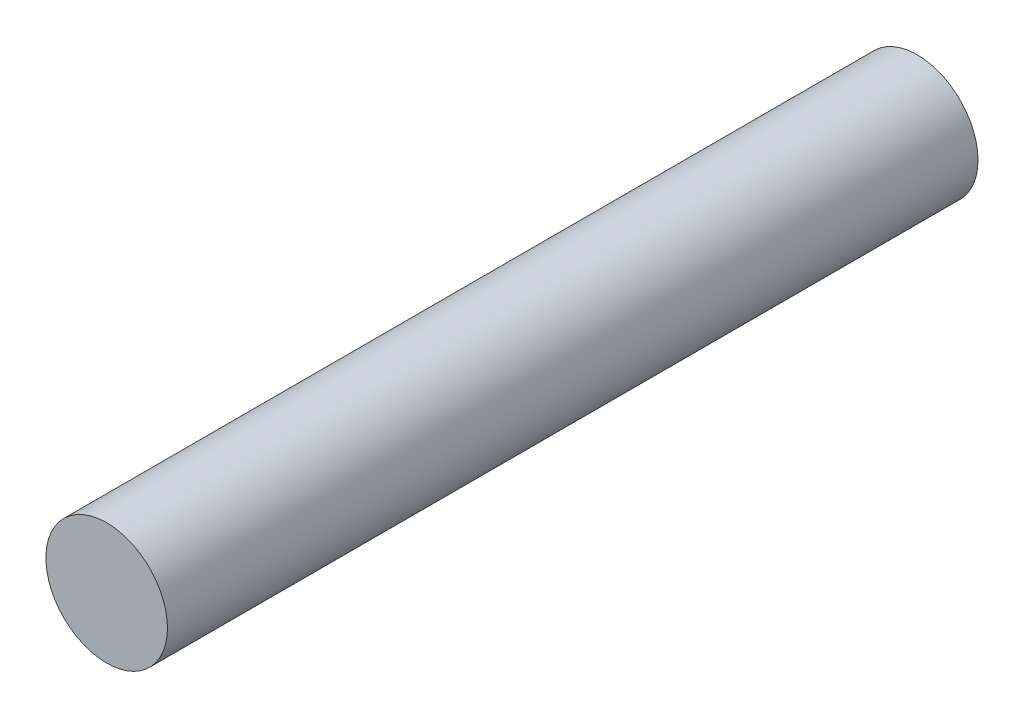
ISO-10303-21;
HEADER;
FILE_DESCRIPTION(('STEP AP214'),'2;1');
FILE_NAME('part.step','',(''),(''),'','','');
FILE_SCHEMA(('AUTOMOTIVE_DESIGN { 1 0 10303 214 1 1 1 1 }'));
ENDSEC;
DATA;
#1=APPLICATION_CONTEXT('core data for automotive mechanical design processes');
#2=APPLICATION_PROTOCOL_DEFINITION('international standard','automotive_design',2000,#1);
#3=PRODUCT_CONTEXT('',#1,'mechanical');
#4=PRODUCT('Part','Part','',(#3));
#5=PRODUCT_RELATED_PRODUCT_CATEGORY('part','',(#4));
#6=PRODUCT_DEFINITION_FORMATION('','',#4);
#7=PRODUCT_DEFINITION_CONTEXT('part definition',#1,'design');
#8=PRODUCT_DEFINITION('design','',#6,#7);
#9=PRODUCT_DEFINITION_SHAPE('','',#8);
#10=(LENGTH_UNIT() NAMED_UNIT(*) SI_UNIT(.MILLI.,.METRE.));
#11=(NAMED_UNIT(*) PLANE_ANGLE_UNIT() SI_UNIT($,.RADIAN.));
#12=(NAMED_UNIT(*) SI_UNIT($,.STERADIAN.) SOLID_ANGLE_UNIT());
#13=UNCERTAINTY_MEASURE_WITH_UNIT(LENGTH_MEASURE(1.E-05),#10,'distance_accuracy_value','');
#14=(GEOMETRIC_REPRESENTATION_CONTEXT(3) GLOBAL_UNCERTAINTY_ASSIGNED_CONTEXT((#13)) GLOBAL_UNIT_ASSIGNED_CONTEXT((#10,
#11,#12)) REPRESENTATION_CONTEXT('',''));
#15=CARTESIAN_POINT('',(0.,0.,0.));
#16=DIRECTION('',(0.,0.,1.));
#17=DIRECTION('',(1.,0.,0.));
#18=AXIS2_PLACEMENT_3D('',#15,#16,#17);
#19=CARTESIAN_POINT('',(0.,0.,254.));
#20=DIRECTION('',(0.,0.,-1.));
#21=DIRECTION('',(-1.,0.,0.));
#22=AXIS2_PLACEMENT_3D('',#19,#20,#21);
#23=CYLINDRICAL_SURFACE('',#22,19.05);
#24=CARTESIAN_POINT('',(0.,0.,254.));
#25=DIRECTION('',(0.,0.,1.));
#26=DIRECTION('',(1.,0.,0.));
#27=AXIS2_PLACEMENT_3D('',#24,#25,#26);
#28=CIRCLE('',#27,19.05);
#29=CARTESIAN_POINT('',(19.05,0.,254.));
#30=VERTEX_POINT('',#29);
#31=EDGE_CURVE('E10',#30,#30,#28,.T.);
#32=ORIENTED_EDGE('',*,*,#31,.F.);
#33=EDGE_LOOP('',(#32));
#34=FACE_BOUND('',#33,.T.);
#35=CARTESIAN_POINT('',(0.,0.,0.));
#36=DIRECTION('',(0.,0.,1.));
#37=DIRECTION('',(1.,0.,0.));
#38=AXIS2_PLACEMENT_3D('',#35,#36,#37);
#39=CIRCLE('',#38,19.05);
#40=CARTESIAN_POINT('',(19.05,0.,0.));
#41=VERTEX_POINT('',#40);
#42=EDGE_CURVE('E34',#41,#41,#39,.T.);
#43=ORIENTED_EDGE('',*,*,#42,.T.);
#44=EDGE_LOOP('',(#43));
#45=FACE_BOUND('',#44,.T.);
#46=ADVANCED_FACE('F31',(#34,#45),#23,.T.);
#47=CARTESIAN_POINT('',(0.,0.,254.));
#48=DIRECTION('',(0.,0.,1.));
#49=DIRECTION('',(1.,0.,0.));
#50=AXIS2_PLACEMENT_3D('',#47,#48,#49);
#51=PLANE('',#50);
#52=ORIENTED_EDGE('',*,*,#31,.T.);
#53=EDGE_LOOP('',(#52));
#54=FACE_BOUND('',#53,.T.);
#55=ADVANCED_FACE('F46',(#54),#51,.T.);
#56=CARTESIAN_POINT('',(0.,0.,0.));
#57=DIRECTION('',(0.,0.,1.));
#58=DIRECTION('',(1.,0.,0.));
#59=AXIS2_PLACEMENT_3D('',#56,#57,#58);
#60=PLANE('',#59);
#61=ORIENTED_EDGE('',*,*,#42,.F.);
#62=EDGE_LOOP('',(#61));
#63=FACE_BOUND('',#62,.T.);
#64=ADVANCED_FACE('F44',(#63),#60,.F.);
#65=CLOSED_SHELL('',(#46,#55,#64));
#66=MANIFOLD_SOLID_BREP('B2',#65);
#67=ADVANCED_BREP_SHAPE_REPRESENTATION('',(#18,#66),#14);
#68=SHAPE_DEFINITION_REPRESENTATION(#9,#67);
ENDSEC;
END-ISO-10303-21;
